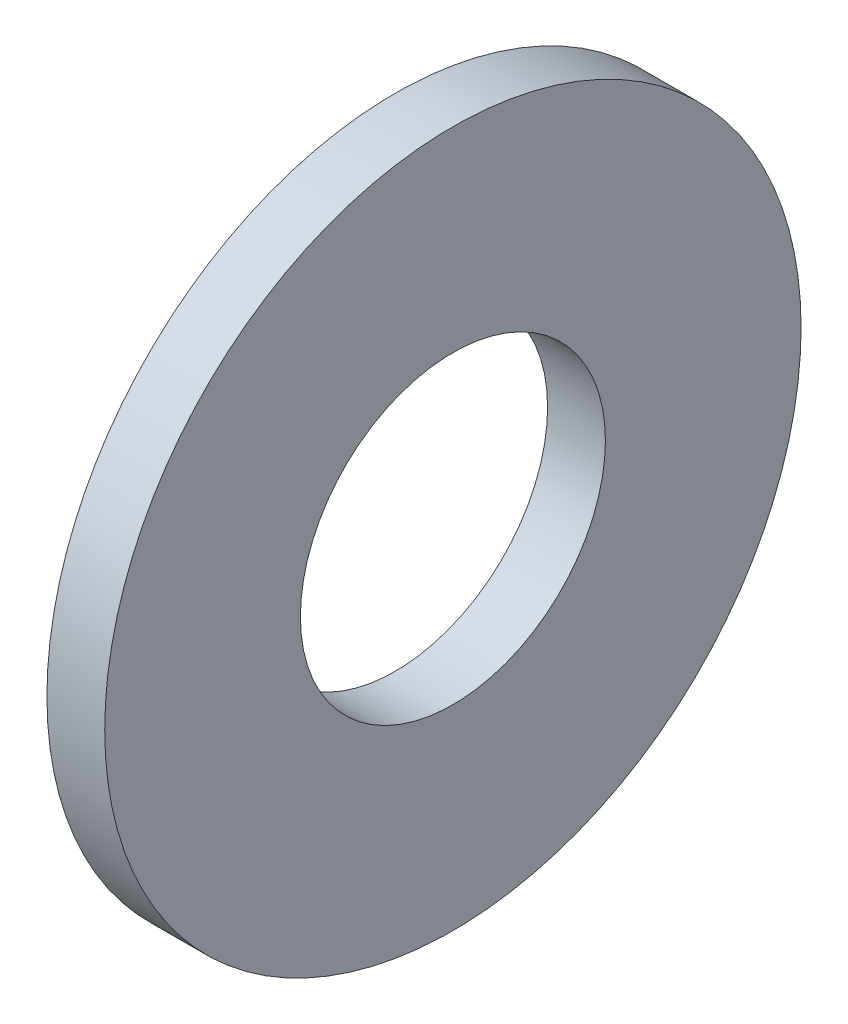
ISO-10303-21;
HEADER;
FILE_DESCRIPTION(('STEP AP214'),'2;1');
FILE_NAME('part.step','',(''),(''),'','','');
FILE_SCHEMA(('AUTOMOTIVE_DESIGN { 1 0 10303 214 1 1 1 1 }'));
ENDSEC;
DATA;
#1=APPLICATION_CONTEXT('core data for automotive mechanical design processes');
#2=APPLICATION_PROTOCOL_DEFINITION('international standard','automotive_design',2000,#1);
#3=PRODUCT_CONTEXT('',#1,'mechanical');
#4=PRODUCT('Part','Part','',(#3));
#5=PRODUCT_RELATED_PRODUCT_CATEGORY('part','',(#4));
#6=PRODUCT_DEFINITION_FORMATION('','',#4);
#7=PRODUCT_DEFINITION_CONTEXT('part definition',#1,'design');
#8=PRODUCT_DEFINITION('design','',#6,#7);
#9=PRODUCT_DEFINITION_SHAPE('','',#8);
#10=(LENGTH_UNIT() NAMED_UNIT(*) SI_UNIT(.MILLI.,.METRE.));
#11=(NAMED_UNIT(*) PLANE_ANGLE_UNIT() SI_UNIT($,.RADIAN.));
#12=(NAMED_UNIT(*) SI_UNIT($,.STERADIAN.) SOLID_ANGLE_UNIT());
#13=UNCERTAINTY_MEASURE_WITH_UNIT(LENGTH_MEASURE(1.E-05),#10,'distance_accuracy_value','');
#14=(GEOMETRIC_REPRESENTATION_CONTEXT(3) GLOBAL_UNCERTAINTY_ASSIGNED_CONTEXT((#13)) GLOBAL_UNIT_ASSIGNED_CONTEXT((#10,
#11,#12)) REPRESENTATION_CONTEXT('',''));
#15=CARTESIAN_POINT('',(0.,0.,0.));
#16=DIRECTION('',(0.,0.,1.));
#17=DIRECTION('',(1.,0.,0.));
#18=AXIS2_PLACEMENT_3D('',#15,#16,#17);
#19=CARTESIAN_POINT('',(-34.9249999999999,0.,0.));
#20=DIRECTION('',(-1.,0.,0.));
#21=DIRECTION('',(0.,0.,1.));
#22=AXIS2_PLACEMENT_3D('',#19,#20,#21);
#23=CYLINDRICAL_SURFACE('',#22,5.5626);
#24=CARTESIAN_POINT('',(0.,0.,0.));
#25=DIRECTION('',(-1.,0.,0.));
#26=DIRECTION('',(0.,0.,1.));
#27=AXIS2_PLACEMENT_3D('',#24,#25,#26);
#28=CIRCLE('',#27,5.5626);
#29=CARTESIAN_POINT('',(0.,0.,5.5626));
#30=VERTEX_POINT('',#29);
#31=EDGE_CURVE('E10',#30,#30,#28,.T.);
#32=ORIENTED_EDGE('',*,*,#31,.F.);
#33=EDGE_LOOP('',(#32));
#34=FACE_BOUND('',#33,.T.);
#35=CARTESIAN_POINT('',(-2.1082,0.,0.));
#36=DIRECTION('',(-1.,0.,0.));
#37=DIRECTION('',(0.,0.,1.));
#38=AXIS2_PLACEMENT_3D('',#35,#36,#37);
#39=CIRCLE('',#38,5.5626);
#40=CARTESIAN_POINT('',(-2.1082,0.,5.5626));
#41=VERTEX_POINT('',#40);
#42=EDGE_CURVE('E48',#41,#41,#39,.T.);
#43=ORIENTED_EDGE('',*,*,#42,.T.);
#44=EDGE_LOOP('',(#43));
#45=FACE_BOUND('',#44,.T.);
#46=ADVANCED_FACE('F34',(#34,#45),#23,.F.);
#47=CARTESIAN_POINT('',(0.,5.5626,0.));
#48=DIRECTION('',(-1.,0.,0.));
#49=DIRECTION('',(0.,0.,1.));
#50=AXIS2_PLACEMENT_3D('',#47,#48,#49);
#51=PLANE('',#50);
#52=CARTESIAN_POINT('',(0.,0.,0.));
#53=DIRECTION('',(-1.,0.,0.));
#54=DIRECTION('',(0.,0.,1.));
#55=AXIS2_PLACEMENT_3D('',#52,#53,#54);
#56=CIRCLE('',#55,12.7);
#57=CARTESIAN_POINT('',(0.,0.,12.7));
#58=VERTEX_POINT('',#57);
#59=EDGE_CURVE('E40',#58,#58,#56,.T.);
#60=ORIENTED_EDGE('',*,*,#59,.F.);
#61=EDGE_LOOP('',(#60));
#62=FACE_BOUND('',#61,.T.);
#63=ORIENTED_EDGE('',*,*,#31,.T.);
#64=EDGE_LOOP('',(#63));
#65=FACE_BOUND('',#64,.T.);
#66=ADVANCED_FACE('F63',(#62,#65),#51,.F.);
#67=CARTESIAN_POINT('',(-34.9249999999999,0.,0.));
#68=DIRECTION('',(-1.,0.,0.));
#69=DIRECTION('',(0.,0.,1.));
#70=AXIS2_PLACEMENT_3D('',#67,#68,#69);
#71=CYLINDRICAL_SURFACE('',#70,12.7);
#72=CARTESIAN_POINT('',(-2.1082,0.,0.));
#73=DIRECTION('',(-1.,0.,0.));
#74=DIRECTION('',(0.,0.,1.));
#75=AXIS2_PLACEMENT_3D('',#72,#73,#74);
#76=CIRCLE('',#75,12.7);
#77=CARTESIAN_POINT('',(-2.1082,0.,12.7));
#78=VERTEX_POINT('',#77);
#79=EDGE_CURVE('E44',#78,#78,#76,.T.);
#80=ORIENTED_EDGE('',*,*,#79,.F.);
#81=EDGE_LOOP('',(#80));
#82=FACE_BOUND('',#81,.T.);
#83=ORIENTED_EDGE('',*,*,#59,.T.);
#84=EDGE_LOOP('',(#83));
#85=FACE_BOUND('',#84,.T.);
#86=ADVANCED_FACE('F58',(#82,#85),#71,.T.);
#87=CARTESIAN_POINT('',(-2.1082,12.7,0.));
#88=DIRECTION('',(1.,0.,0.));
#89=DIRECTION('',(0.,0.,-1.));
#90=AXIS2_PLACEMENT_3D('',#87,#88,#89);
#91=PLANE('',#90);
#92=ORIENTED_EDGE('',*,*,#42,.F.);
#93=EDGE_LOOP('',(#92));
#94=FACE_BOUND('',#93,.T.);
#95=ORIENTED_EDGE('',*,*,#79,.T.);
#96=EDGE_LOOP('',(#95));
#97=FACE_BOUND('',#96,.T.);
#98=ADVANCED_FACE('F55',(#94,#97),#91,.F.);
#99=CLOSED_SHELL('',(#46,#66,#86,#98));
#100=MANIFOLD_SOLID_BREP('B2',#99);
#101=ADVANCED_BREP_SHAPE_REPRESENTATION('',(#18,#100),#14);
#102=SHAPE_DEFINITION_REPRESENTATION(#9,#101);
ENDSEC;
END-ISO-10303-21;
